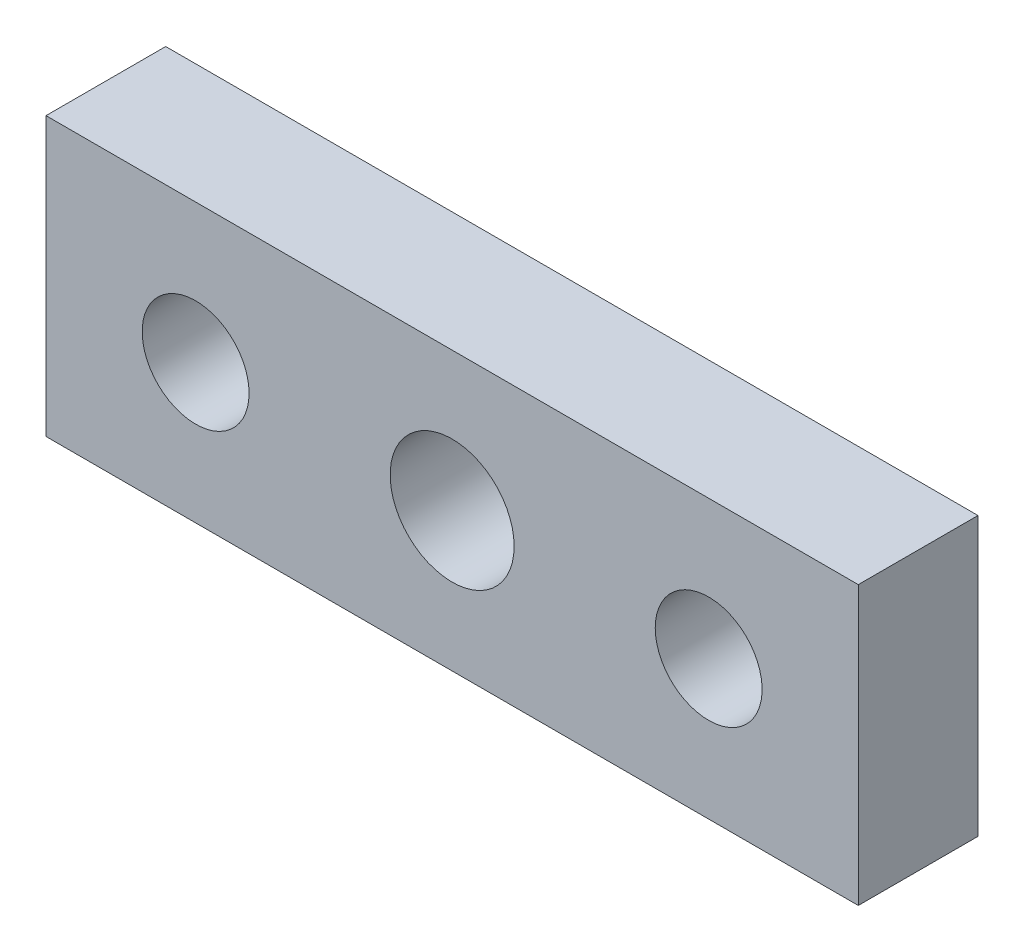
ISO-10303-21;
HEADER;
FILE_DESCRIPTION(('STEP AP214'),'2;1');
FILE_NAME('part.step','',(''),(''),'','','');
FILE_SCHEMA(('AUTOMOTIVE_DESIGN { 1 0 10303 214 1 1 1 1 }'));
ENDSEC;
DATA;
#1=APPLICATION_CONTEXT('core data for automotive mechanical design processes');
#2=APPLICATION_PROTOCOL_DEFINITION('international standard','automotive_design',2000,#1);
#3=PRODUCT_CONTEXT('',#1,'mechanical');
#4=PRODUCT('Part','Part','',(#3));
#5=PRODUCT_RELATED_PRODUCT_CATEGORY('part','',(#4));
#6=PRODUCT_DEFINITION_FORMATION('','',#4);
#7=PRODUCT_DEFINITION_CONTEXT('part definition',#1,'design');
#8=PRODUCT_DEFINITION('design','',#6,#7);
#9=PRODUCT_DEFINITION_SHAPE('','',#8);
#10=(LENGTH_UNIT() NAMED_UNIT(*) SI_UNIT(.MILLI.,.METRE.));
#11=(NAMED_UNIT(*) PLANE_ANGLE_UNIT() SI_UNIT($,.RADIAN.));
#12=(NAMED_UNIT(*) SI_UNIT($,.STERADIAN.) SOLID_ANGLE_UNIT());
#13=UNCERTAINTY_MEASURE_WITH_UNIT(LENGTH_MEASURE(1.E-05),#10,'distance_accuracy_value','');
#14=(GEOMETRIC_REPRESENTATION_CONTEXT(3) GLOBAL_UNCERTAINTY_ASSIGNED_CONTEXT((#13)) GLOBAL_UNIT_ASSIGNED_CONTEXT((#10,
#11,#12)) REPRESENTATION_CONTEXT('',''));
#15=CARTESIAN_POINT('',(0.,0.,0.));
#16=DIRECTION('',(0.,0.,1.));
#17=DIRECTION('',(1.,0.,0.));
#18=AXIS2_PLACEMENT_3D('',#15,#16,#17);
#19=CARTESIAN_POINT('',(19.,6.5,5.6));
#20=DIRECTION('',(0.,0.,-1.));
#21=DIRECTION('',(-1.,0.,0.));
#22=AXIS2_PLACEMENT_3D('',#19,#20,#21);
#23=PLANE('',#22);
#24=CARTESIAN_POINT('',(-12.,0.,5.6));
#25=DIRECTION('',(0.,0.,1.));
#26=DIRECTION('',(1.,0.,0.));
#27=AXIS2_PLACEMENT_3D('',#24,#25,#26);
#28=CIRCLE('',#27,2.5);
#29=CARTESIAN_POINT('',(-9.49999999999999,0.,5.6));
#30=VERTEX_POINT('',#29);
#31=EDGE_CURVE('E115',#30,#30,#28,.T.);
#32=ORIENTED_EDGE('',*,*,#31,.F.);
#33=EDGE_LOOP('',(#32));
#34=FACE_BOUND('',#33,.T.);
#35=DIRECTION('',(0.,1.,0.));
#36=VECTOR('',#35,1.);
#37=CARTESIAN_POINT('',(19.,-6.5,5.6));
#38=LINE('',#37,#36);
#39=CARTESIAN_POINT('',(19.,-6.5,5.6));
#40=VERTEX_POINT('',#39);
#41=CARTESIAN_POINT('',(19.,6.5,5.6));
#42=VERTEX_POINT('',#41);
#43=EDGE_CURVE('E85',#40,#42,#38,.T.);
#44=ORIENTED_EDGE('',*,*,#43,.T.);
#45=DIRECTION('',(-1.,0.,0.));
#46=VECTOR('',#45,1.);
#47=CARTESIAN_POINT('',(-19.,6.5,5.6));
#48=LINE('',#47,#46);
#49=CARTESIAN_POINT('',(-19.,6.5,5.6));
#50=VERTEX_POINT('',#49);
#51=EDGE_CURVE('E80',#42,#50,#48,.T.);
#52=ORIENTED_EDGE('',*,*,#51,.T.);
#53=DIRECTION('',(0.,-1.,0.));
#54=VECTOR('',#53,1.);
#55=CARTESIAN_POINT('',(-19.,-6.5,5.6));
#56=LINE('',#55,#54);
#57=CARTESIAN_POINT('',(-19.,-6.5,5.6));
#58=VERTEX_POINT('',#57);
#59=EDGE_CURVE('E83',#50,#58,#56,.T.);
#60=ORIENTED_EDGE('',*,*,#59,.T.);
#61=DIRECTION('',(1.,0.,0.));
#62=VECTOR('',#61,1.);
#63=CARTESIAN_POINT('',(-19.,-6.5,5.6));
#64=LINE('',#63,#62);
#65=EDGE_CURVE('E50',#58,#40,#64,.T.);
#66=ORIENTED_EDGE('',*,*,#65,.T.);
#67=EDGE_LOOP('',(#44,#52,#60,#66));
#68=FACE_BOUND('',#67,.T.);
#69=CARTESIAN_POINT('',(0.,0.,5.6));
#70=DIRECTION('',(0.,0.,1.));
#71=DIRECTION('',(1.,0.,0.));
#72=AXIS2_PLACEMENT_3D('',#69,#70,#71);
#73=CIRCLE('',#72,2.9);
#74=CARTESIAN_POINT('',(2.9,0.,5.6));
#75=VERTEX_POINT('',#74);
#76=EDGE_CURVE('E100',#75,#75,#73,.T.);
#77=ORIENTED_EDGE('',*,*,#76,.F.);
#78=EDGE_LOOP('',(#77));
#79=FACE_BOUND('',#78,.T.);
#80=CARTESIAN_POINT('',(12.,0.,5.6));
#81=DIRECTION('',(0.,0.,1.));
#82=DIRECTION('',(-1.,0.,0.));
#83=AXIS2_PLACEMENT_3D('',#80,#81,#82);
#84=CIRCLE('',#83,2.5);
#85=CARTESIAN_POINT('',(9.5,0.,5.6));
#86=VERTEX_POINT('',#85);
#87=EDGE_CURVE('E121',#86,#86,#84,.T.);
#88=ORIENTED_EDGE('',*,*,#87,.F.);
#89=EDGE_LOOP('',(#88));
#90=FACE_BOUND('',#89,.T.);
#91=ADVANCED_FACE('F33',(#34,#68,#79,#90),#23,.F.);
#92=CARTESIAN_POINT('',(19.,6.5,0.));
#93=DIRECTION('',(0.,0.,-1.));
#94=DIRECTION('',(-1.,0.,0.));
#95=AXIS2_PLACEMENT_3D('',#92,#93,#94);
#96=PLANE('',#95);
#97=CARTESIAN_POINT('',(-12.,0.,0.));
#98=DIRECTION('',(0.,0.,1.));
#99=DIRECTION('',(1.,0.,0.));
#100=AXIS2_PLACEMENT_3D('',#97,#98,#99);
#101=CIRCLE('',#100,2.5);
#102=CARTESIAN_POINT('',(-9.49999999999999,0.,0.));
#103=VERTEX_POINT('',#102);
#104=EDGE_CURVE('E118',#103,#103,#101,.T.);
#105=ORIENTED_EDGE('',*,*,#104,.T.);
#106=EDGE_LOOP('',(#105));
#107=FACE_BOUND('',#106,.T.);
#108=DIRECTION('',(0.,1.,0.));
#109=VECTOR('',#108,1.);
#110=CARTESIAN_POINT('',(19.,-6.5,0.));
#111=LINE('',#110,#109);
#112=CARTESIAN_POINT('',(19.,-6.5,0.));
#113=VERTEX_POINT('',#112);
#114=CARTESIAN_POINT('',(19.,6.5,0.));
#115=VERTEX_POINT('',#114);
#116=EDGE_CURVE('E97',#113,#115,#111,.T.);
#117=ORIENTED_EDGE('',*,*,#116,.F.);
#118=DIRECTION('',(1.,0.,0.));
#119=VECTOR('',#118,1.);
#120=CARTESIAN_POINT('',(-19.,-6.5,0.));
#121=LINE('',#120,#119);
#122=CARTESIAN_POINT('',(-19.,-6.5,0.));
#123=VERTEX_POINT('',#122);
#124=EDGE_CURVE('E73',#123,#113,#121,.T.);
#125=ORIENTED_EDGE('',*,*,#124,.F.);
#126=DIRECTION('',(0.,-1.,0.));
#127=VECTOR('',#126,1.);
#128=CARTESIAN_POINT('',(-19.,-6.5,0.));
#129=LINE('',#128,#127);
#130=CARTESIAN_POINT('',(-19.,6.5,0.));
#131=VERTEX_POINT('',#130);
#132=EDGE_CURVE('E67',#131,#123,#129,.T.);
#133=ORIENTED_EDGE('',*,*,#132,.F.);
#134=DIRECTION('',(-1.,0.,0.));
#135=VECTOR('',#134,1.);
#136=CARTESIAN_POINT('',(-19.,6.5,0.));
#137=LINE('',#136,#135);
#138=EDGE_CURVE('E89',#115,#131,#137,.T.);
#139=ORIENTED_EDGE('',*,*,#138,.F.);
#140=EDGE_LOOP('',(#117,#125,#133,#139));
#141=FACE_BOUND('',#140,.T.);
#142=CARTESIAN_POINT('',(0.,0.,0.));
#143=DIRECTION('',(0.,0.,1.));
#144=DIRECTION('',(1.,0.,0.));
#145=AXIS2_PLACEMENT_3D('',#142,#143,#144);
#146=CIRCLE('',#145,2.9);
#147=CARTESIAN_POINT('',(2.9,0.,0.));
#148=VERTEX_POINT('',#147);
#149=EDGE_CURVE('E112',#148,#148,#146,.T.);
#150=ORIENTED_EDGE('',*,*,#149,.T.);
#151=EDGE_LOOP('',(#150));
#152=FACE_BOUND('',#151,.T.);
#153=CARTESIAN_POINT('',(12.,0.,0.));
#154=DIRECTION('',(0.,0.,1.));
#155=DIRECTION('',(-1.,0.,0.));
#156=AXIS2_PLACEMENT_3D('',#153,#154,#155);
#157=CIRCLE('',#156,2.5);
#158=CARTESIAN_POINT('',(9.5,0.,0.));
#159=VERTEX_POINT('',#158);
#160=EDGE_CURVE('E124',#159,#159,#157,.T.);
#161=ORIENTED_EDGE('',*,*,#160,.T.);
#162=EDGE_LOOP('',(#161));
#163=FACE_BOUND('',#162,.T.);
#164=ADVANCED_FACE('F108',(#107,#141,#152,#163),#96,.T.);
#165=CARTESIAN_POINT('',(19.,-6.5,5.6));
#166=DIRECTION('',(-1.,0.,0.));
#167=DIRECTION('',(0.,0.,1.));
#168=AXIS2_PLACEMENT_3D('',#165,#166,#167);
#169=PLANE('',#168);
#170=ORIENTED_EDGE('',*,*,#116,.T.);
#171=DIRECTION('',(0.,0.,-1.));
#172=VECTOR('',#171,1.);
#173=CARTESIAN_POINT('',(19.,6.5,5.6));
#174=LINE('',#173,#172);
#175=EDGE_CURVE('E11',#42,#115,#174,.T.);
#176=ORIENTED_EDGE('',*,*,#175,.F.);
#177=ORIENTED_EDGE('',*,*,#43,.F.);
#178=DIRECTION('',(0.,0.,-1.));
#179=VECTOR('',#178,1.);
#180=CARTESIAN_POINT('',(19.,-6.5,5.6));
#181=LINE('',#180,#179);
#182=EDGE_CURVE('E93',#40,#113,#181,.T.);
#183=ORIENTED_EDGE('',*,*,#182,.T.);
#184=EDGE_LOOP('',(#170,#176,#177,#183));
#185=FACE_BOUND('',#184,.T.);
#186=ADVANCED_FACE('F35',(#185),#169,.F.);
#187=CARTESIAN_POINT('',(-19.,6.5,5.6));
#188=DIRECTION('',(0.,-1.,0.));
#189=DIRECTION('',(0.,0.,-1.));
#190=AXIS2_PLACEMENT_3D('',#187,#188,#189);
#191=PLANE('',#190);
#192=ORIENTED_EDGE('',*,*,#138,.T.);
#193=DIRECTION('',(0.,0.,-1.));
#194=VECTOR('',#193,1.);
#195=CARTESIAN_POINT('',(-19.,6.5,5.6));
#196=LINE('',#195,#194);
#197=EDGE_CURVE('E42',#50,#131,#196,.T.);
#198=ORIENTED_EDGE('',*,*,#197,.F.);
#199=ORIENTED_EDGE('',*,*,#51,.F.);
#200=ORIENTED_EDGE('',*,*,#175,.T.);
#201=EDGE_LOOP('',(#192,#198,#199,#200));
#202=FACE_BOUND('',#201,.T.);
#203=ADVANCED_FACE('F88',(#202),#191,.F.);
#204=CARTESIAN_POINT('',(-19.,-6.5,5.6));
#205=DIRECTION('',(1.,0.,0.));
#206=DIRECTION('',(0.,0.,-1.));
#207=AXIS2_PLACEMENT_3D('',#204,#205,#206);
#208=PLANE('',#207);
#209=ORIENTED_EDGE('',*,*,#132,.T.);
#210=DIRECTION('',(0.,0.,-1.));
#211=VECTOR('',#210,1.);
#212=CARTESIAN_POINT('',(-19.,-6.5,5.6));
#213=LINE('',#212,#211);
#214=EDGE_CURVE('E90',#58,#123,#213,.T.);
#215=ORIENTED_EDGE('',*,*,#214,.F.);
#216=ORIENTED_EDGE('',*,*,#59,.F.);
#217=ORIENTED_EDGE('',*,*,#197,.T.);
#218=EDGE_LOOP('',(#209,#215,#216,#217));
#219=FACE_BOUND('',#218,.T.);
#220=ADVANCED_FACE('F91',(#219),#208,.F.);
#221=CARTESIAN_POINT('',(-19.,-6.5,5.6));
#222=DIRECTION('',(0.,1.,0.));
#223=DIRECTION('',(0.,0.,1.));
#224=AXIS2_PLACEMENT_3D('',#221,#222,#223);
#225=PLANE('',#224);
#226=ORIENTED_EDGE('',*,*,#124,.T.);
#227=ORIENTED_EDGE('',*,*,#182,.F.);
#228=ORIENTED_EDGE('',*,*,#65,.F.);
#229=ORIENTED_EDGE('',*,*,#214,.T.);
#230=EDGE_LOOP('',(#226,#227,#228,#229));
#231=FACE_BOUND('',#230,.T.);
#232=ADVANCED_FACE('F105',(#231),#225,.F.);
#233=CARTESIAN_POINT('',(0.,0.,5.6));
#234=DIRECTION('',(0.,0.,-1.));
#235=DIRECTION('',(-1.,0.,0.));
#236=AXIS2_PLACEMENT_3D('',#233,#234,#235);
#237=CYLINDRICAL_SURFACE('',#236,2.9);
#238=ORIENTED_EDGE('',*,*,#76,.T.);
#239=EDGE_LOOP('',(#238));
#240=FACE_BOUND('',#239,.T.);
#241=ORIENTED_EDGE('',*,*,#149,.F.);
#242=EDGE_LOOP('',(#241));
#243=FACE_BOUND('',#242,.T.);
#244=ADVANCED_FACE('F143',(#240,#243),#237,.F.);
#245=CARTESIAN_POINT('',(-12.,0.,5.6));
#246=DIRECTION('',(0.,0.,-1.));
#247=DIRECTION('',(-1.,0.,0.));
#248=AXIS2_PLACEMENT_3D('',#245,#246,#247);
#249=CYLINDRICAL_SURFACE('',#248,2.5);
#250=ORIENTED_EDGE('',*,*,#31,.T.);
#251=EDGE_LOOP('',(#250));
#252=FACE_BOUND('',#251,.T.);
#253=ORIENTED_EDGE('',*,*,#104,.F.);
#254=EDGE_LOOP('',(#253));
#255=FACE_BOUND('',#254,.T.);
#256=ADVANCED_FACE('F189',(#252,#255),#249,.F.);
#257=CARTESIAN_POINT('',(12.,0.,5.6));
#258=DIRECTION('',(0.,0.,-1.));
#259=DIRECTION('',(-1.,0.,0.));
#260=AXIS2_PLACEMENT_3D('',#257,#258,#259);
#261=CYLINDRICAL_SURFACE('',#260,2.5);
#262=ORIENTED_EDGE('',*,*,#87,.T.);
#263=EDGE_LOOP('',(#262));
#264=FACE_BOUND('',#263,.T.);
#265=ORIENTED_EDGE('',*,*,#160,.F.);
#266=EDGE_LOOP('',(#265));
#267=FACE_BOUND('',#266,.T.);
#268=ADVANCED_FACE('F130',(#264,#267),#261,.F.);
#269=CLOSED_SHELL('',(#91,#164,#186,#203,#220,#232,#244,#256,#268));
#270=MANIFOLD_SOLID_BREP('B2',#269);
#271=ADVANCED_BREP_SHAPE_REPRESENTATION('',(#18,#270),#14);
#272=SHAPE_DEFINITION_REPRESENTATION(#9,#271);
ENDSEC;
END-ISO-10303-21;
